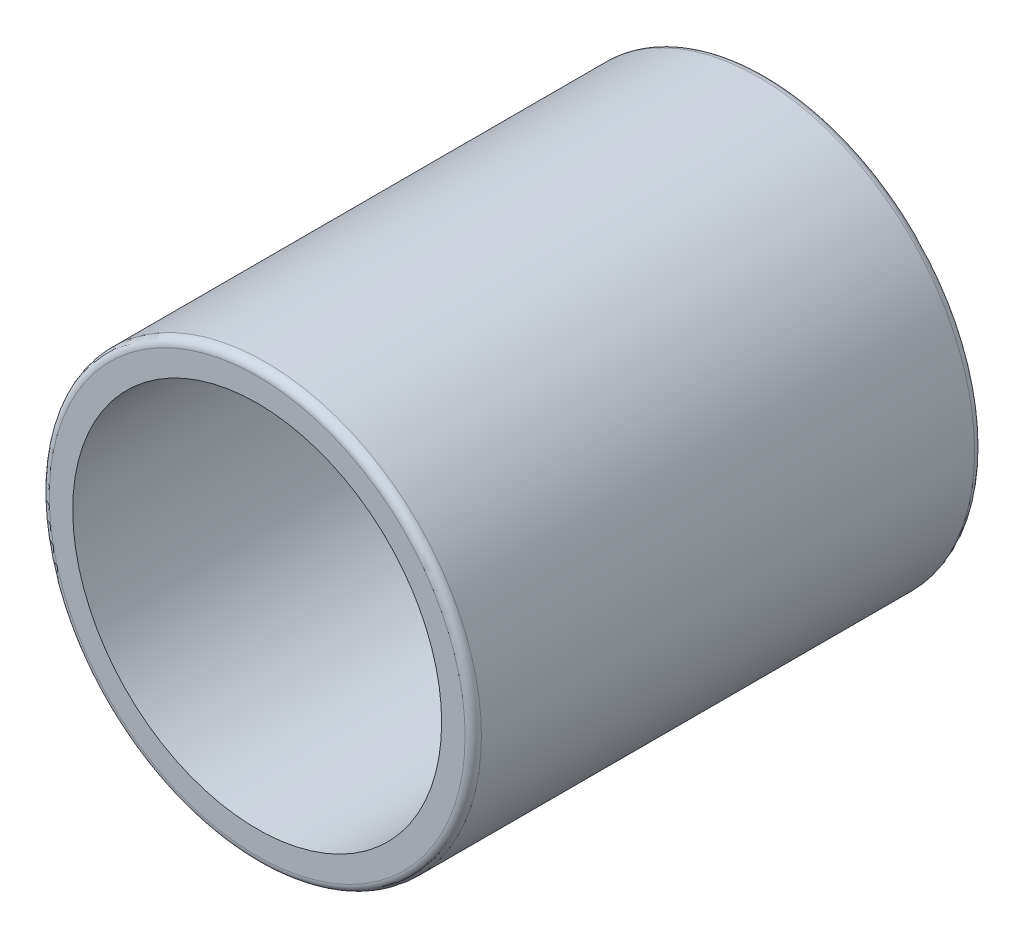
ISO-10303-21;
HEADER;
FILE_DESCRIPTION(('STEP AP214'),'2;1');
FILE_NAME('part.step','',(''),(''),'','','');
FILE_SCHEMA(('AUTOMOTIVE_DESIGN { 1 0 10303 214 1 1 1 1 }'));
ENDSEC;
DATA;
#1=APPLICATION_CONTEXT('core data for automotive mechanical design processes');
#2=APPLICATION_PROTOCOL_DEFINITION('international standard','automotive_design',2000,#1);
#3=PRODUCT_CONTEXT('',#1,'mechanical');
#4=PRODUCT('Part','Part','',(#3));
#5=PRODUCT_RELATED_PRODUCT_CATEGORY('part','',(#4));
#6=PRODUCT_DEFINITION_FORMATION('','',#4);
#7=PRODUCT_DEFINITION_CONTEXT('part definition',#1,'design');
#8=PRODUCT_DEFINITION('design','',#6,#7);
#9=PRODUCT_DEFINITION_SHAPE('','',#8);
#10=(LENGTH_UNIT() NAMED_UNIT(*) SI_UNIT(.MILLI.,.METRE.));
#11=(NAMED_UNIT(*) PLANE_ANGLE_UNIT() SI_UNIT($,.RADIAN.));
#12=(NAMED_UNIT(*) SI_UNIT($,.STERADIAN.) SOLID_ANGLE_UNIT());
#13=UNCERTAINTY_MEASURE_WITH_UNIT(LENGTH_MEASURE(1.E-05),#10,'distance_accuracy_value','');
#14=(GEOMETRIC_REPRESENTATION_CONTEXT(3) GLOBAL_UNCERTAINTY_ASSIGNED_CONTEXT((#13)) GLOBAL_UNIT_ASSIGNED_CONTEXT((#10,
#11,#12)) REPRESENTATION_CONTEXT('',''));
#15=CARTESIAN_POINT('',(0.,0.,0.));
#16=DIRECTION('',(0.,0.,1.));
#17=DIRECTION('',(1.,0.,0.));
#18=AXIS2_PLACEMENT_3D('',#15,#16,#17);
#19=CARTESIAN_POINT('',(0.,0.,12.5));
#20=DIRECTION('',(0.,0.,1.));
#21=DIRECTION('',(1.,0.,0.));
#22=AXIS2_PLACEMENT_3D('',#19,#20,#21);
#23=PLANE('',#22);
#24=CARTESIAN_POINT('',(0.,0.,12.5));
#25=DIRECTION('',(0.,0.,1.));
#26=DIRECTION('',(1.,0.,0.));
#27=AXIS2_PLACEMENT_3D('',#24,#25,#26);
#28=CIRCLE('',#27,5.1);
#29=CARTESIAN_POINT('',(5.1,0.,12.5));
#30=VERTEX_POINT('',#29);
#31=EDGE_CURVE('E12',#30,#30,#28,.T.);
#32=ORIENTED_EDGE('',*,*,#31,.T.);
#33=EDGE_LOOP('',(#32));
#34=FACE_BOUND('',#33,.T.);
#35=CARTESIAN_POINT('',(0.,0.,12.5));
#36=DIRECTION('',(0.,0.,1.));
#37=DIRECTION('',(1.,0.,0.));
#38=AXIS2_PLACEMENT_3D('',#35,#36,#37);
#39=CIRCLE('',#38,4.525);
#40=CARTESIAN_POINT('',(4.525,0.,12.5));
#41=VERTEX_POINT('',#40);
#42=EDGE_CURVE('E111',#41,#41,#39,.T.);
#43=ORIENTED_EDGE('',*,*,#42,.F.);
#44=EDGE_LOOP('',(#43));
#45=FACE_BOUND('',#44,.T.);
#46=ADVANCED_FACE('F52',(#34,#45),#23,.T.);
#47=CARTESIAN_POINT('',(0.,0.,0.));
#48=DIRECTION('',(0.,0.,1.));
#49=DIRECTION('',(1.,0.,0.));
#50=AXIS2_PLACEMENT_3D('',#47,#48,#49);
#51=PLANE('',#50);
#52=DIRECTION('',(1.,0.,0.));
#53=VECTOR('',#52,1.);
#54=CARTESIAN_POINT('',(0.,2.5,0.));
#55=LINE('',#54,#53);
#56=CARTESIAN_POINT('',(-4.44522215417857,2.5,0.));
#57=VERTEX_POINT('',#56);
#58=CARTESIAN_POINT('',(-3.77168728820405,2.5,0.));
#59=VERTEX_POINT('',#58);
#60=EDGE_CURVE('E104',#57,#59,#55,.T.);
#61=ORIENTED_EDGE('',*,*,#60,.F.);
#62=CARTESIAN_POINT('',(0.,0.,0.));
#63=DIRECTION('',(0.,0.,1.));
#64=DIRECTION('',(1.,0.,0.));
#65=AXIS2_PLACEMENT_3D('',#62,#63,#64);
#66=CIRCLE('',#65,5.1);
#67=CARTESIAN_POINT('',(-4.44522215417857,-2.5,0.));
#68=VERTEX_POINT('',#67);
#69=EDGE_CURVE('E68',#57,#68,#66,.F.);
#70=ORIENTED_EDGE('',*,*,#69,.T.);
#71=DIRECTION('',(1.,0.,0.));
#72=VECTOR('',#71,1.);
#73=CARTESIAN_POINT('',(0.,-2.5,0.));
#74=LINE('',#73,#72);
#75=CARTESIAN_POINT('',(-3.77168728820405,-2.5,0.));
#76=VERTEX_POINT('',#75);
#77=EDGE_CURVE('E200',#68,#76,#74,.T.);
#78=ORIENTED_EDGE('',*,*,#77,.T.);
#79=CARTESIAN_POINT('',(0.,0.,0.));
#80=DIRECTION('',(0.,0.,1.));
#81=DIRECTION('',(1.,0.,0.));
#82=AXIS2_PLACEMENT_3D('',#79,#80,#81);
#83=CIRCLE('',#82,4.525);
#84=EDGE_CURVE('E158',#76,#59,#83,.T.);
#85=ORIENTED_EDGE('',*,*,#84,.T.);
#86=EDGE_LOOP('',(#61,#70,#78,#85));
#87=FACE_BOUND('',#86,.T.);
#88=ADVANCED_FACE('F165',(#87),#51,.F.);
#89=CARTESIAN_POINT('',(0.,0.,12.5));
#90=DIRECTION('',(0.,0.,-1.));
#91=DIRECTION('',(-1.,0.,0.));
#92=AXIS2_PLACEMENT_3D('',#89,#90,#91);
#93=CYLINDRICAL_SURFACE('',#92,5.3);
#94=CARTESIAN_POINT('',(0.,0.,12.3));
#95=DIRECTION('',(0.,0.,1.));
#96=DIRECTION('',(1.,0.,0.));
#97=AXIS2_PLACEMENT_3D('',#94,#95,#96);
#98=CIRCLE('',#97,5.3);
#99=CARTESIAN_POINT('',(5.3,0.,12.3));
#100=VERTEX_POINT('',#99);
#101=EDGE_CURVE('E132',#100,#100,#98,.F.);
#102=ORIENTED_EDGE('',*,*,#101,.T.);
#103=EDGE_LOOP('',(#102));
#104=FACE_BOUND('',#103,.T.);
#105=DIRECTION('',(0.,0.,-1.));
#106=VECTOR('',#105,1.);
#107=CARTESIAN_POINT('',(-4.67332857821917,-2.5,12.5));
#108=LINE('',#107,#106);
#109=CARTESIAN_POINT('',(-4.67332857821917,-2.5,3.));
#110=VERTEX_POINT('',#109);
#111=CARTESIAN_POINT('',(-4.67332857821917,-2.5,0.200000000000001));
#112=VERTEX_POINT('',#111);
#113=EDGE_CURVE('E159',#110,#112,#108,.T.);
#114=ORIENTED_EDGE('',*,*,#113,.T.);
#115=CARTESIAN_POINT('',(0.,0.,0.200000000000001));
#116=DIRECTION('',(0.,0.,1.));
#117=DIRECTION('',(1.,0.,0.));
#118=AXIS2_PLACEMENT_3D('',#115,#116,#117);
#119=CIRCLE('',#118,5.3);
#120=CARTESIAN_POINT('',(-4.67332857821917,2.5,0.200000000000001));
#121=VERTEX_POINT('',#120);
#122=EDGE_CURVE('E213',#112,#121,#119,.T.);
#123=ORIENTED_EDGE('',*,*,#122,.T.);
#124=DIRECTION('',(0.,0.,-1.));
#125=VECTOR('',#124,1.);
#126=CARTESIAN_POINT('',(-4.67332857821917,2.5,12.5));
#127=LINE('',#126,#125);
#128=CARTESIAN_POINT('',(-4.67332857821917,2.5,3.));
#129=VERTEX_POINT('',#128);
#130=EDGE_CURVE('E203',#129,#121,#127,.T.);
#131=ORIENTED_EDGE('',*,*,#130,.F.);
#132=CARTESIAN_POINT('',(-4.67332857821917,2.5,3.));
#133=CARTESIAN_POINT('',(-4.67331102198767,2.50001123803153,3.06602286773266));
#134=CARTESIAN_POINT('',(-4.67472725103053,2.49738495368611,3.13203607034987));
#135=CARTESIAN_POINT('',(-4.68029541273214,2.48694558609356,3.26350038491167));
#136=CARTESIAN_POINT('',(-4.68444587262866,2.47913529513538,3.32895178025147));
#137=CARTESIAN_POINT('',(-4.69532265686589,2.45846963220763,3.45848562579863));
#138=CARTESIAN_POINT('',(-4.70203553133944,2.44564059456268,3.52257340974238));
#139=CARTESIAN_POINT('',(-4.71779531226775,2.4150987406336,3.64926835275914));
#140=CARTESIAN_POINT('',(-4.72684244545744,2.39738544991296,3.71187536735444));
#141=CARTESIAN_POINT('',(-4.75702200499959,2.33725611927078,3.89663521204479));
#142=CARTESIAN_POINT('',(-4.78122440967033,2.28779388135632,4.01607559863897));
#143=CARTESIAN_POINT('',(-4.83504547743333,2.17173001780569,4.2450406602458));
#144=CARTESIAN_POINT('',(-4.86467153685481,2.10510493577103,4.35455148542648));
#145=CARTESIAN_POINT('',(-4.92861081582809,1.95095880532773,4.56921835431548));
#146=CARTESIAN_POINT('',(-4.96310806371864,1.86227494876188,4.67348656733696));
#147=CARTESIAN_POINT('',(-5.03140485172418,1.66897293001189,4.866328176973));
#148=CARTESIAN_POINT('',(-5.06520421582521,1.56435080244233,4.95489765590096));
#149=CARTESIAN_POINT('',(-5.13067295687098,1.33463731337796,5.11891263243652));
#150=CARTESIAN_POINT('',(-5.16210212985875,1.20870663968349,5.1932875410864));
#151=CARTESIAN_POINT('',(-5.21692919964635,0.944362964415787,5.31939362597836));
#152=CARTESIAN_POINT('',(-5.24033160029684,0.805957018001292,5.37113750507192));
#153=CARTESIAN_POINT('',(-5.27514029507465,0.53005816665004,5.44707321018361));
#154=CARTESIAN_POINT('',(-5.28722312187377,0.39308244499053,5.47282721019371));
#155=CARTESIAN_POINT('',(-5.30053268308979,0.11625737522973,5.50116243325445));
#156=CARTESIAN_POINT('',(-5.30176498953971,-0.0235904609751945,5.50375555004921));
#157=CARTESIAN_POINT('',(-5.29358322021194,-0.29058548605289,5.48637536881785));
#158=CARTESIAN_POINT('',(-5.28498791247977,-0.417876089699689,5.46813767186157));
#159=CARTESIAN_POINT('',(-5.25931440614394,-0.667337536806303,5.41267285360469));
#160=CARTESIAN_POINT('',(-5.24223573915153,-0.789508097171035,5.37544468378668));
#161=CARTESIAN_POINT('',(-5.2008720671557,-1.02749573971544,5.2827202839135));
#162=CARTESIAN_POINT('',(-5.17648415161218,-1.14319203367669,5.22696184704857));
#163=CARTESIAN_POINT('',(-5.1227667123995,-1.36388428319968,5.09907194302784));
#164=CARTESIAN_POINT('',(-5.09343530078097,-1.46887612599114,5.02693421685974));
#165=CARTESIAN_POINT('',(-5.0296614104454,-1.67484661448836,4.86114080398001));
#166=CARTESIAN_POINT('',(-4.9949962922343,-1.77469417127403,4.76616423022918));
#167=CARTESIAN_POINT('',(-4.92618183513221,-1.95762743776001,4.56096297237999));
#168=CARTESIAN_POINT('',(-4.89203289538329,-2.04070073426553,4.45072709711686));
#169=CARTESIAN_POINT('',(-4.82625188258364,-2.19190599148806,4.21105655127117));
#170=CARTESIAN_POINT('',(-4.79484460770962,-2.25903022698014,4.08091961478812));
#171=CARTESIAN_POINT('',(-4.74105798978781,-2.36985316457031,3.80943456309453));
#172=CARTESIAN_POINT('',(-4.71865908437174,-2.4136026953022,3.66811154743785));
#173=CARTESIAN_POINT('',(-4.69302318387649,-2.46291675757215,3.43786247141304));
#174=CARTESIAN_POINT('',(-4.68569659377568,-2.47677846052391,3.35109415437442));
#175=CARTESIAN_POINT('',(-4.67582488576875,-2.49533532145312,3.17624310602716));
#176=CARTESIAN_POINT('',(-4.67328389595084,-2.50002256562276,3.08815930591944));
#177=CARTESIAN_POINT('',(-4.67332857821917,-2.5,3.));
#178=B_SPLINE_CURVE_WITH_KNOTS('',3,(#132,#133,#134,#135,#136,#137,#138,#139,#140,#141,#142,
#143,#144,#145,#146,#147,#148,#149,#150,#151,#152,#153,#154,#155,#156,#157,#158,#159,#160,#161,
#162,#163,#164,#165,#166,#167,#168,#169,#170,#171,#172,#173,#174,#175,#176,#177),.UNSPECIFIED.,
.F.,.F.,(4,2,2,2,2,2,2,2,2,2,2,2,2,2,2,2,2,2,2,2,2,2,4),(0.,0.19798529542916,0.395864035437355,
0.59271810188523,0.789591296677677,1.18228676924496,1.5755218113574,1.9971981683642,
2.41897960881212,2.86543039930989,3.31163027328739,3.72904311573856,4.14624159299861,
4.53106429372347,4.91590824389194,5.30644774948505,5.69713674372187,6.12159164822664,
6.54635951354102,6.99332590761371,7.43931636973244,7.70326828122246,7.96744777515489),.UNSPECIFIED.);
#179=EDGE_CURVE('E118',#129,#110,#178,.T.);
#180=ORIENTED_EDGE('',*,*,#179,.T.);
#181=EDGE_LOOP('',(#114,#123,#131,#180));
#182=FACE_BOUND('',#181,.T.);
#183=ADVANCED_FACE('F161',(#104,#182),#93,.T.);
#184=CARTESIAN_POINT('',(0.,0.,12.5));
#185=DIRECTION('',(0.,0.,-1.));
#186=DIRECTION('',(-1.,0.,0.));
#187=AXIS2_PLACEMENT_3D('',#184,#185,#186);
#188=CYLINDRICAL_SURFACE('',#187,4.525);
#189=DIRECTION('',(0.,0.,-1.));
#190=VECTOR('',#189,1.);
#191=CARTESIAN_POINT('',(-3.77168728820405,-2.5,12.5));
#192=LINE('',#191,#190);
#193=CARTESIAN_POINT('',(-3.77168728820405,-2.5,3.));
#194=VERTEX_POINT('',#193);
#195=EDGE_CURVE('E126',#194,#76,#192,.T.);
#196=ORIENTED_EDGE('',*,*,#195,.F.);
#197=CARTESIAN_POINT('',(-3.77168728820405,2.5,3.));
#198=CARTESIAN_POINT('',(-3.77166443142266,2.50001294065784,3.06435339714763));
#199=CARTESIAN_POINT('',(-3.77333371134613,2.4975156769365,3.12869377217664));
#200=CARTESIAN_POINT('',(-3.77988353580877,2.48760309524606,3.25678107365135));
#201=CARTESIAN_POINT('',(-3.78476156703413,2.48019162638273,3.32052842499439));
#202=CARTESIAN_POINT('',(-3.79751251816339,2.46062002929391,3.4465311040437));
#203=CARTESIAN_POINT('',(-3.80536467305199,2.44849281063594,3.50879366519517));
#204=CARTESIAN_POINT('',(-3.82375944967201,2.41966547870736,3.63183549075606));
#205=CARTESIAN_POINT('',(-3.83430248741548,2.40296465832609,3.69261452421792));
#206=CARTESIAN_POINT('',(-3.86936801720735,2.34639926595992,3.87180358706343));
#207=CARTESIAN_POINT('',(-3.89737919291643,2.29999654974546,3.98753762732945));
#208=CARTESIAN_POINT('',(-3.95947736841293,2.19136236760737,4.20966406818793));
#209=CARTESIAN_POINT('',(-3.99357593841906,2.12910066083524,4.3160380932416));
#210=CARTESIAN_POINT('',(-4.0681757613037,1.98316392351716,4.52815450090953));
#211=CARTESIAN_POINT('',(-4.10897570757716,1.89795881789892,4.63274178537088));
#212=CARTESIAN_POINT('',(-4.18997644765724,1.71173550820463,4.8270424390397));
#213=CARTESIAN_POINT('',(-4.23017704826449,1.61071232091603,4.91675110259331));
#214=CARTESIAN_POINT('',(-4.30962966122325,1.38500081771137,5.08647736587476));
#215=CARTESIAN_POINT('',(-4.34849478326477,1.25901821515307,5.16497256813344));
#216=CARTESIAN_POINT('',(-4.41680953363576,0.993078656755157,5.29911297639876));
#217=CARTESIAN_POINT('',(-4.44626618149667,0.853132221930092,5.35477522660941));
#218=CARTESIAN_POINT('',(-4.49024486401811,0.575650715311336,5.4367526764002));
#219=CARTESIAN_POINT('',(-4.50581154584402,0.438896303315735,5.46513624221754));
#220=CARTESIAN_POINT('',(-4.52423355629236,0.161757950146473,5.4986540963196));
#221=CARTESIAN_POINT('',(-4.52709846309503,0.0213768241920262,5.50380590330627));
#222=CARTESIAN_POINT('',(-4.520196706278,-0.243090538341379,5.49129710471286));
#223=CARTESIAN_POINT('',(-4.51173237576679,-0.367331645046693,5.47598873909339));
#224=CARTESIAN_POINT('',(-4.48521598661333,-0.611146850152625,5.42733460685287));
#225=CARTESIAN_POINT('',(-4.46716334698558,-0.730720665276151,5.39398774722104));
#226=CARTESIAN_POINT('',(-4.42283361447028,-0.963521329673313,5.31021739574618));
#227=CARTESIAN_POINT('',(-4.39647158085437,-1.07666770364318,5.25961707699851));
#228=CARTESIAN_POINT('',(-4.33775950306104,-1.2930806772835,5.14314258266583));
#229=CARTESIAN_POINT('',(-4.30540755415335,-1.39634411839613,5.07726354692088));
#230=CARTESIAN_POINT('',(-4.23346651054772,-1.60203114248746,4.92397628695684));
#231=CARTESIAN_POINT('',(-4.19347307088752,-1.70315112236517,4.83500867670995));
#232=CARTESIAN_POINT('',(-4.11272833077414,-1.88983069315839,4.64212832466123));
#233=CARTESIAN_POINT('',(-4.0719761444678,-1.97537065114193,4.53819701769725));
#234=CARTESIAN_POINT('',(-3.99017382723443,-2.13611289214727,4.30712369340087));
#235=CARTESIAN_POINT('',(-3.94942669920575,-2.20969291574215,4.1787347317539));
#236=CARTESIAN_POINT('',(-3.87751579234286,-2.333595644744,3.90897444743331));
#237=CARTESIAN_POINT('',(-3.84632416196232,-2.38398616078177,3.76764244484306));
#238=CARTESIAN_POINT('',(-3.80625462438735,-2.44723871245371,3.52133235723999));
#239=CARTESIAN_POINT('',(-3.79345353171995,-2.46689935364803,3.41872690517189));
#240=CARTESIAN_POINT('',(-3.78048138101502,-2.48669331481988,3.26290363766674));
#241=CARTESIAN_POINT('',(-3.77719525991817,-2.4916753350836,3.21052468685045));
#242=CARTESIAN_POINT('',(-3.77279356879337,-2.49833154754757,3.10543625473043));
#243=CARTESIAN_POINT('',(-3.77167926225553,-2.50000381425108,3.05272659890954));
#244=CARTESIAN_POINT('',(-3.77168728820405,-2.5,3.));
#245=B_SPLINE_CURVE_WITH_KNOTS('',3,(#197,#198,#199,#200,#201,#202,#203,#204,#205,#206,#207,
#208,#209,#210,#211,#212,#213,#214,#215,#216,#217,#218,#219,#220,#221,#222,#223,#224,#225,#226,
#227,#228,#229,#230,#231,#232,#233,#234,#235,#236,#237,#238,#239,#240,#241,#242,#243,#244),
.UNSPECIFIED.,.F.,.F.,(4,2,2,2,2,2,2,2,2,2,2,2,2,2,2,2,2,2,2,2,2,2,2,4),(0.,0.192968907398067,
0.385786848020372,0.577282654528637,0.768808084352001,1.15043461672101,1.53279437698293,
1.95387917383653,2.37509689405352,2.83296505159961,3.29049079778016,3.70967661308333,
4.12854627407482,4.50316982419734,4.87781607651742,5.25642354288758,5.6351516098836,
6.05492008798692,6.4752139256066,6.93331779347204,7.39007342877245,7.70469899395388,
7.86271646032797,8.02082582864588),.UNSPECIFIED.);
#246=CARTESIAN_POINT('',(-3.77168728820405,2.5,3.));
#247=VERTEX_POINT('',#246);
#248=EDGE_CURVE('E110',#247,#194,#245,.T.);
#249=ORIENTED_EDGE('',*,*,#248,.F.);
#250=DIRECTION('',(0.,0.,-1.));
#251=VECTOR('',#250,1.);
#252=CARTESIAN_POINT('',(-3.77168728820405,2.5,12.5));
#253=LINE('',#252,#251);
#254=EDGE_CURVE('E99',#247,#59,#253,.T.);
#255=ORIENTED_EDGE('',*,*,#254,.T.);
#256=ORIENTED_EDGE('',*,*,#84,.F.);
#257=EDGE_LOOP('',(#196,#249,#255,#256));
#258=FACE_BOUND('',#257,.T.);
#259=ORIENTED_EDGE('',*,*,#42,.T.);
#260=EDGE_LOOP('',(#259));
#261=FACE_BOUND('',#260,.T.);
#262=ADVANCED_FACE('F123',(#258,#261),#188,.F.);
#263=CARTESIAN_POINT('',(-12.5,0.,3.));
#264=DIRECTION('',(1.,0.,0.));
#265=DIRECTION('',(0.,0.,-1.));
#266=AXIS2_PLACEMENT_3D('',#263,#264,#265);
#267=CYLINDRICAL_SURFACE('',#266,2.5);
#268=DIRECTION('',(1.,0.,0.));
#269=VECTOR('',#268,1.);
#270=CARTESIAN_POINT('',(-12.5,2.5,3.));
#271=LINE('',#270,#269);
#272=EDGE_CURVE('E102',#247,#129,#271,.F.);
#273=ORIENTED_EDGE('',*,*,#272,.F.);
#274=ORIENTED_EDGE('',*,*,#248,.T.);
#275=DIRECTION('',(1.,0.,0.));
#276=VECTOR('',#275,1.);
#277=CARTESIAN_POINT('',(-12.5,-2.5,3.));
#278=LINE('',#277,#276);
#279=EDGE_CURVE('E120',#194,#110,#278,.F.);
#280=ORIENTED_EDGE('',*,*,#279,.T.);
#281=ORIENTED_EDGE('',*,*,#179,.F.);
#282=EDGE_LOOP('',(#273,#274,#280,#281));
#283=FACE_BOUND('',#282,.T.);
#284=ADVANCED_FACE('F114',(#283),#267,.F.);
#285=CARTESIAN_POINT('',(-12.5,-2.5,3.));
#286=DIRECTION('',(0.,-1.,0.));
#287=DIRECTION('',(0.,0.,-1.));
#288=AXIS2_PLACEMENT_3D('',#285,#286,#287);
#289=PLANE('',#288);
#290=ORIENTED_EDGE('',*,*,#77,.F.);
#291=CARTESIAN_POINT('',(-4.44522215417857,-2.5,0.));
#292=CARTESIAN_POINT('',(-4.4595302186383,-2.5,-2.79368856200885E-06));
#293=CARTESIAN_POINT('',(-4.47384992415415,-2.5,0.0011668525495196));
#294=CARTESIAN_POINT('',(-4.50216247383065,-2.5,0.00586403971218191));
#295=CARTESIAN_POINT('',(-4.51615353087381,-2.5,0.00940230252451819));
#296=CARTESIAN_POINT('',(-4.54335179701438,-2.5,0.0188606929709024));
#297=CARTESIAN_POINT('',(-4.55655713397477,-2.5,0.0247862669950101));
#298=CARTESIAN_POINT('',(-4.58163731821293,-2.5,0.0389656610966441));
#299=CARTESIAN_POINT('',(-4.59351449203878,-2.5,0.0472153179088441));
#300=CARTESIAN_POINT('',(-4.61445789962989,-2.5,0.0650987611902004));
#301=CARTESIAN_POINT('',(-4.62367840116682,-2.5,0.0745511336974546));
#302=CARTESIAN_POINT('',(-4.64010868831765,-2.5,0.0950789255694155));
#303=CARTESIAN_POINT('',(-4.64731937891434,-2.5,0.106153610996697));
#304=CARTESIAN_POINT('',(-4.6584987968368,-2.5,0.128010912057521));
#305=CARTESIAN_POINT('',(-4.6627697128919,-2.5,0.138639334362402));
#306=CARTESIAN_POINT('',(-4.66922473308762,-2.5,0.160492974119669));
#307=CARTESIAN_POINT('',(-4.6714144641318,-2.5,0.171716495246712));
#308=CARTESIAN_POINT('',(-4.67305753211469,-2.5,0.188675161223168));
#309=CARTESIAN_POINT('',(-4.67333251467979,-2.5,0.194339277631208));
#310=CARTESIAN_POINT('',(-4.67332857821917,-2.5,0.2));
#311=B_SPLINE_CURVE_WITH_KNOTS('',3,(#291,#292,#293,#294,#295,#296,#297,#298,#299,#300,#301,
#302,#303,#304,#305,#306,#307,#308,#309,#310),.UNSPECIFIED.,.F.,.F.,(4,2,2,2,2,2,2,2,2,4),(0.,
0.0428957144907277,0.0859869276113931,0.129177010409813,0.172290210949447,0.211674721559189,
0.25104146925568,0.285215080088695,0.31929603060302,0.33628120077909),.UNSPECIFIED.);
#312=EDGE_CURVE('E61',#68,#112,#311,.T.);
#313=ORIENTED_EDGE('',*,*,#312,.T.);
#314=ORIENTED_EDGE('',*,*,#113,.F.);
#315=ORIENTED_EDGE('',*,*,#279,.F.);
#316=ORIENTED_EDGE('',*,*,#195,.T.);
#317=EDGE_LOOP('',(#290,#313,#314,#315,#316));
#318=FACE_BOUND('',#317,.T.);
#319=ADVANCED_FACE('F147',(#318),#289,.F.);
#320=CARTESIAN_POINT('',(-12.5,2.5,3.));
#321=DIRECTION('',(0.,-1.,0.));
#322=DIRECTION('',(0.,0.,-1.));
#323=AXIS2_PLACEMENT_3D('',#320,#321,#322);
#324=PLANE('',#323);
#325=ORIENTED_EDGE('',*,*,#130,.T.);
#326=CARTESIAN_POINT('',(-4.67332857821917,2.5,0.200000000000001));
#327=CARTESIAN_POINT('',(-4.67334307205255,2.5,0.18970909344225));
#328=CARTESIAN_POINT('',(-4.67242884318253,2.5,0.179428408886275));
#329=CARTESIAN_POINT('',(-4.66885910908825,2.5,0.159213303913629));
#330=CARTESIAN_POINT('',(-4.6662103493908,2.5,0.149277698480965));
#331=CARTESIAN_POINT('',(-4.65928838463292,2.5,0.13000088153456));
#332=CARTESIAN_POINT('',(-4.65501624141488,2.5,0.120659286136038));
#333=CARTESIAN_POINT('',(-4.64502987286513,2.5,0.102778586872693));
#334=CARTESIAN_POINT('',(-4.63931462588189,2.5,0.0942400574443841));
#335=CARTESIAN_POINT('',(-4.62636598475935,2.5,0.0777732326790684));
#336=CARTESIAN_POINT('',(-4.61907579326124,2.5,0.0698897627695455));
#337=CARTESIAN_POINT('',(-4.60339703429127,2.5,0.0553100144251328));
#338=CARTESIAN_POINT('',(-4.59500825896431,2.5,0.04861396121857));
#339=CARTESIAN_POINT('',(-4.5763783449253,2.5,0.0358022779055641));
#340=CARTESIAN_POINT('',(-4.56603496809772,2.5,0.0298354734262487));
#341=CARTESIAN_POINT('',(-4.54456881828107,2.5,0.0195059521247758));
#342=CARTESIAN_POINT('',(-4.53344519197374,2.5,0.015145025185645));
#343=CARTESIAN_POINT('',(-4.50964313570181,2.5,0.0077244405363825));
#344=CARTESIAN_POINT('',(-4.49691589287981,2.5,0.00482174595045064));
#345=CARTESIAN_POINT('',(-4.47119634309379,2.5,0.000960487807053329));
#346=CARTESIAN_POINT('',(-4.45820465690474,2.5,-2.19417683500529E-06));
#347=CARTESIAN_POINT('',(-4.44522215417857,2.5,0.));
#348=B_SPLINE_CURVE_WITH_KNOTS('',3,(#326,#327,#328,#329,#330,#331,#332,#333,#334,#335,#336,
#337,#338,#339,#340,#341,#342,#343,#344,#345,#346,#347),.UNSPECIFIED.,.F.,.F.,(4,2,2,2,2,2,2,2,
2,2,4),(0.,0.0308161815572522,0.0615132261981774,0.0921902266095173,0.122889006127781,
0.154970886155229,0.187058844956188,0.222737923482959,0.258456649775793,0.297467192998182,
0.336394833657324),.UNSPECIFIED.);
#349=EDGE_CURVE('E76',#121,#57,#348,.T.);
#350=ORIENTED_EDGE('',*,*,#349,.T.);
#351=ORIENTED_EDGE('',*,*,#60,.T.);
#352=ORIENTED_EDGE('',*,*,#254,.F.);
#353=ORIENTED_EDGE('',*,*,#272,.T.);
#354=EDGE_LOOP('',(#325,#350,#351,#352,#353));
#355=FACE_BOUND('',#354,.T.);
#356=ADVANCED_FACE('F101',(#355),#324,.T.);
#357=CARTESIAN_POINT('',(0.,0.,0.200000000000001));
#358=DIRECTION('',(0.,0.,1.));
#359=DIRECTION('',(1.,0.,0.));
#360=AXIS2_PLACEMENT_3D('',#357,#358,#359);
#361=TOROIDAL_SURFACE('',#360,5.1,0.2);
#362=ORIENTED_EDGE('',*,*,#312,.F.);
#363=ORIENTED_EDGE('',*,*,#69,.F.);
#364=ORIENTED_EDGE('',*,*,#349,.F.);
#365=ORIENTED_EDGE('',*,*,#122,.F.);
#366=EDGE_LOOP('',(#362,#363,#364,#365));
#367=FACE_BOUND('',#366,.T.);
#368=ADVANCED_FACE('F167',(#367),#361,.T.);
#369=CARTESIAN_POINT('',(0.,0.,12.3));
#370=DIRECTION('',(0.,0.,1.));
#371=DIRECTION('',(1.,0.,0.));
#372=AXIS2_PLACEMENT_3D('',#369,#370,#371);
#373=TOROIDAL_SURFACE('',#372,5.1,0.2);
#374=ORIENTED_EDGE('',*,*,#101,.F.);
#375=EDGE_LOOP('',(#374));
#376=FACE_BOUND('',#375,.T.);
#377=ORIENTED_EDGE('',*,*,#31,.F.);
#378=EDGE_LOOP('',(#377));
#379=FACE_BOUND('',#378,.T.);
#380=ADVANCED_FACE('F54',(#376,#379),#373,.T.);
#381=CLOSED_SHELL('',(#46,#88,#183,#262,#284,#319,#356,#368,#380));
#382=MANIFOLD_SOLID_BREP('B2',#381);
#383=ADVANCED_BREP_SHAPE_REPRESENTATION('',(#18,#382),#14);
#384=SHAPE_DEFINITION_REPRESENTATION(#9,#383);
ENDSEC;
END-ISO-10303-21;
